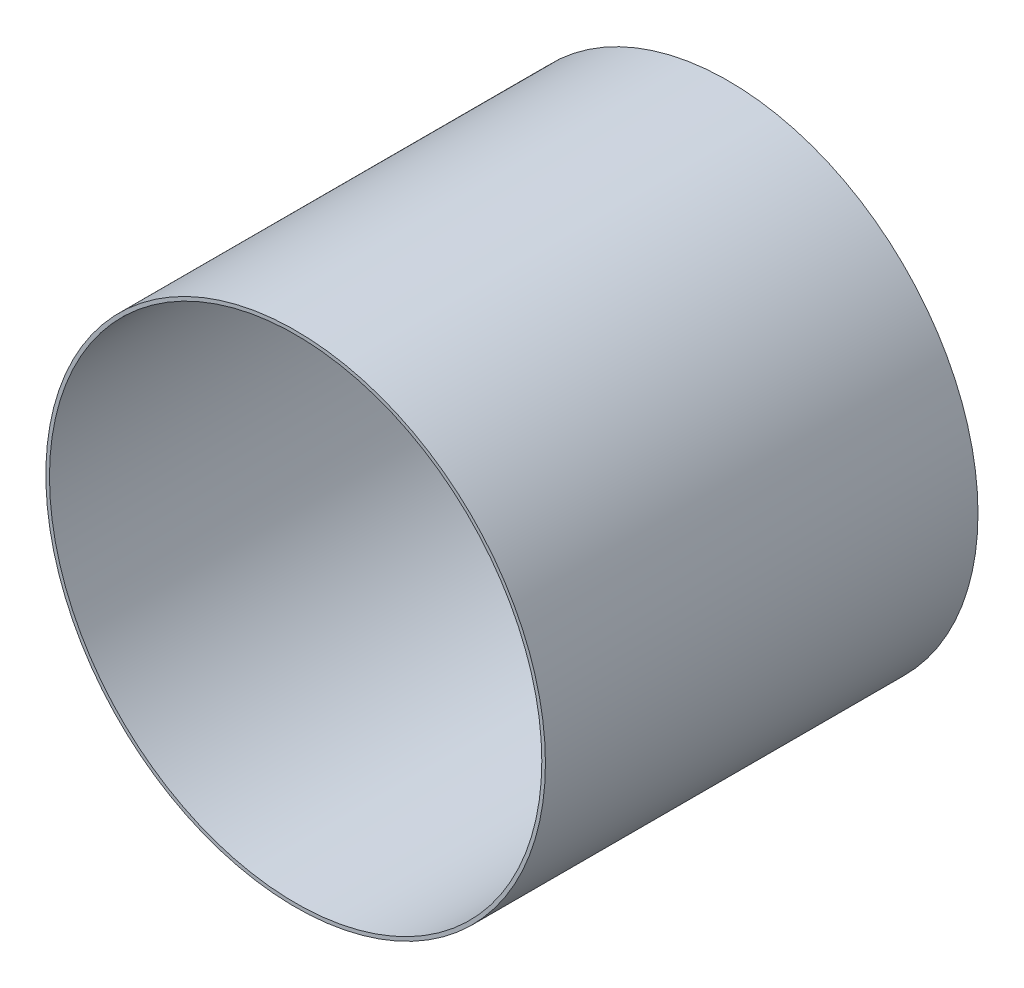
ISO-10303-21;
HEADER;
FILE_DESCRIPTION(('STEP AP214'),'2;1');
FILE_NAME('part.step','',(''),(''),'','','');
FILE_SCHEMA(('AUTOMOTIVE_DESIGN { 1 0 10303 214 1 1 1 1 }'));
ENDSEC;
DATA;
#1=APPLICATION_CONTEXT('core data for automotive mechanical design processes');
#2=APPLICATION_PROTOCOL_DEFINITION('international standard','automotive_design',2000,#1);
#3=PRODUCT_CONTEXT('',#1,'mechanical');
#4=PRODUCT('Part','Part','',(#3));
#5=PRODUCT_RELATED_PRODUCT_CATEGORY('part','',(#4));
#6=PRODUCT_DEFINITION_FORMATION('','',#4);
#7=PRODUCT_DEFINITION_CONTEXT('part definition',#1,'design');
#8=PRODUCT_DEFINITION('design','',#6,#7);
#9=PRODUCT_DEFINITION_SHAPE('','',#8);
#10=(LENGTH_UNIT() NAMED_UNIT(*) SI_UNIT(.MILLI.,.METRE.));
#11=(NAMED_UNIT(*) PLANE_ANGLE_UNIT() SI_UNIT($,.RADIAN.));
#12=(NAMED_UNIT(*) SI_UNIT($,.STERADIAN.) SOLID_ANGLE_UNIT());
#13=UNCERTAINTY_MEASURE_WITH_UNIT(LENGTH_MEASURE(1.E-05),#10,'distance_accuracy_value','');
#14=(GEOMETRIC_REPRESENTATION_CONTEXT(3) GLOBAL_UNCERTAINTY_ASSIGNED_CONTEXT((#13)) GLOBAL_UNIT_ASSIGNED_CONTEXT((#10,
#11,#12)) REPRESENTATION_CONTEXT('',''));
#15=CARTESIAN_POINT('',(0.,0.,0.));
#16=DIRECTION('',(0.,0.,1.));
#17=DIRECTION('',(1.,0.,0.));
#18=AXIS2_PLACEMENT_3D('',#15,#16,#17);
#19=CARTESIAN_POINT('',(0.,0.,776.3));
#20=DIRECTION('',(0.,0.,1.));
#21=DIRECTION('',(1.,0.,0.));
#22=AXIS2_PLACEMENT_3D('',#19,#20,#21);
#23=PLANE('',#22);
#24=CARTESIAN_POINT('',(0.,0.,776.3));
#25=DIRECTION('',(0.,0.,1.));
#26=DIRECTION('',(1.,0.,0.));
#27=AXIS2_PLACEMENT_3D('',#24,#25,#26);
#28=CIRCLE('',#27,448.3);
#29=CARTESIAN_POINT('',(448.3,0.,776.3));
#30=VERTEX_POINT('',#29);
#31=EDGE_CURVE('E10',#30,#30,#28,.T.);
#32=ORIENTED_EDGE('',*,*,#31,.T.);
#33=EDGE_LOOP('',(#32));
#34=FACE_BOUND('',#33,.T.);
#35=CARTESIAN_POINT('',(0.,0.,776.3));
#36=DIRECTION('',(0.,0.,1.));
#37=DIRECTION('',(1.,0.,0.));
#38=AXIS2_PLACEMENT_3D('',#35,#36,#37);
#39=CIRCLE('',#38,441.8);
#40=CARTESIAN_POINT('',(441.8,0.,776.3));
#41=VERTEX_POINT('',#40);
#42=EDGE_CURVE('E48',#41,#41,#39,.T.);
#43=ORIENTED_EDGE('',*,*,#42,.F.);
#44=EDGE_LOOP('',(#43));
#45=FACE_BOUND('',#44,.T.);
#46=ADVANCED_FACE('F37',(#34,#45),#23,.T.);
#47=CARTESIAN_POINT('',(0.,0.,0.));
#48=DIRECTION('',(0.,0.,1.));
#49=DIRECTION('',(1.,0.,0.));
#50=AXIS2_PLACEMENT_3D('',#47,#48,#49);
#51=PLANE('',#50);
#52=CARTESIAN_POINT('',(0.,0.,0.));
#53=DIRECTION('',(0.,0.,1.));
#54=DIRECTION('',(1.,0.,0.));
#55=AXIS2_PLACEMENT_3D('',#52,#53,#54);
#56=CIRCLE('',#55,448.3);
#57=CARTESIAN_POINT('',(448.3,0.,0.));
#58=VERTEX_POINT('',#57);
#59=EDGE_CURVE('E41',#58,#58,#56,.T.);
#60=ORIENTED_EDGE('',*,*,#59,.F.);
#61=EDGE_LOOP('',(#60));
#62=FACE_BOUND('',#61,.T.);
#63=CARTESIAN_POINT('',(0.,0.,0.));
#64=DIRECTION('',(0.,0.,1.));
#65=DIRECTION('',(1.,0.,0.));
#66=AXIS2_PLACEMENT_3D('',#63,#64,#65);
#67=CIRCLE('',#66,441.8);
#68=CARTESIAN_POINT('',(441.8,0.,0.));
#69=VERTEX_POINT('',#68);
#70=EDGE_CURVE('E50',#69,#69,#67,.T.);
#71=ORIENTED_EDGE('',*,*,#70,.T.);
#72=EDGE_LOOP('',(#71));
#73=FACE_BOUND('',#72,.T.);
#74=ADVANCED_FACE('F60',(#62,#73),#51,.F.);
#75=CARTESIAN_POINT('',(0.,0.,776.3));
#76=DIRECTION('',(0.,0.,-1.));
#77=DIRECTION('',(-1.,0.,0.));
#78=AXIS2_PLACEMENT_3D('',#75,#76,#77);
#79=CYLINDRICAL_SURFACE('',#78,448.3);
#80=ORIENTED_EDGE('',*,*,#31,.F.);
#81=EDGE_LOOP('',(#80));
#82=FACE_BOUND('',#81,.T.);
#83=ORIENTED_EDGE('',*,*,#59,.T.);
#84=EDGE_LOOP('',(#83));
#85=FACE_BOUND('',#84,.T.);
#86=ADVANCED_FACE('F39',(#82,#85),#79,.T.);
#87=CARTESIAN_POINT('',(0.,0.,776.3));
#88=DIRECTION('',(0.,0.,-1.));
#89=DIRECTION('',(-1.,0.,0.));
#90=AXIS2_PLACEMENT_3D('',#87,#88,#89);
#91=CYLINDRICAL_SURFACE('',#90,441.8);
#92=ORIENTED_EDGE('',*,*,#42,.T.);
#93=EDGE_LOOP('',(#92));
#94=FACE_BOUND('',#93,.T.);
#95=ORIENTED_EDGE('',*,*,#70,.F.);
#96=EDGE_LOOP('',(#95));
#97=FACE_BOUND('',#96,.T.);
#98=ADVANCED_FACE('F56',(#94,#97),#91,.F.);
#99=CLOSED_SHELL('',(#46,#74,#86,#98));
#100=MANIFOLD_SOLID_BREP('B2',#99);
#101=ADVANCED_BREP_SHAPE_REPRESENTATION('',(#18,#100),#14);
#102=SHAPE_DEFINITION_REPRESENTATION(#9,#101);
ENDSEC;
END-ISO-10303-21;
